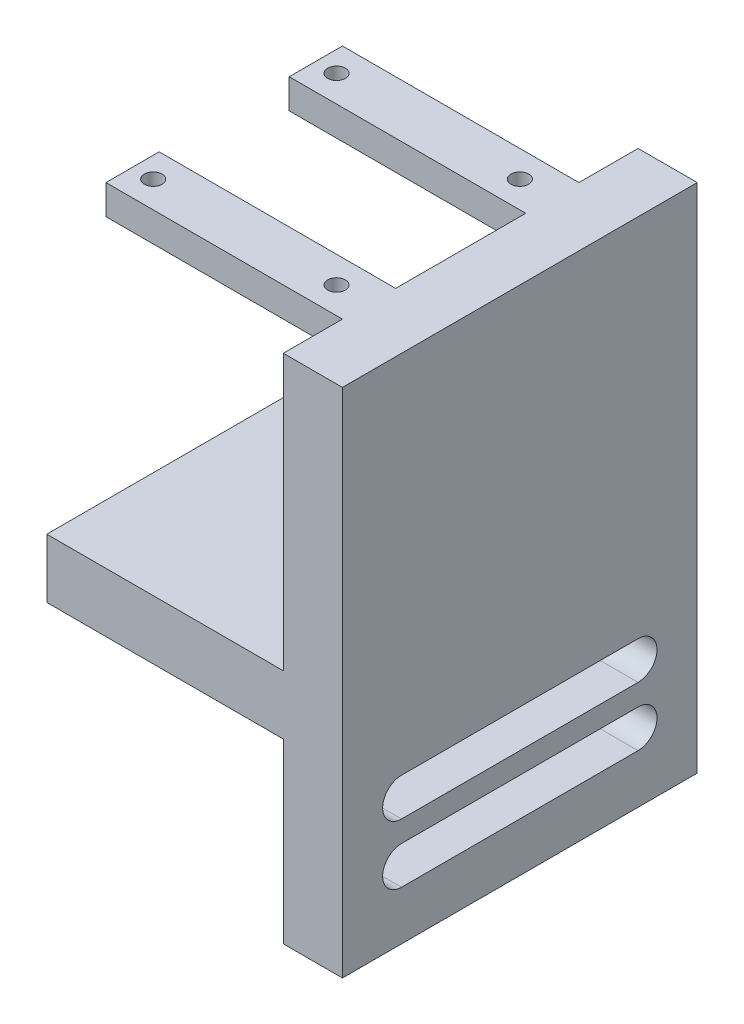
ISO-10303-21;
HEADER;
FILE_DESCRIPTION(('STEP AP214'),'2;1');
FILE_NAME('part.step','',(''),(''),'','','');
FILE_SCHEMA(('AUTOMOTIVE_DESIGN { 1 0 10303 214 1 1 1 1 }'));
ENDSEC;
DATA;
#1=APPLICATION_CONTEXT('core data for automotive mechanical design processes');
#2=APPLICATION_PROTOCOL_DEFINITION('international standard','automotive_design',2000,#1);
#3=PRODUCT_CONTEXT('',#1,'mechanical');
#4=PRODUCT('Part','Part','',(#3));
#5=PRODUCT_RELATED_PRODUCT_CATEGORY('part','',(#4));
#6=PRODUCT_DEFINITION_FORMATION('','',#4);
#7=PRODUCT_DEFINITION_CONTEXT('part definition',#1,'design');
#8=PRODUCT_DEFINITION('design','',#6,#7);
#9=PRODUCT_DEFINITION_SHAPE('','',#8);
#10=(LENGTH_UNIT() NAMED_UNIT(*) SI_UNIT(.MILLI.,.METRE.));
#11=(NAMED_UNIT(*) PLANE_ANGLE_UNIT() SI_UNIT($,.RADIAN.));
#12=(NAMED_UNIT(*) SI_UNIT($,.STERADIAN.) SOLID_ANGLE_UNIT());
#13=UNCERTAINTY_MEASURE_WITH_UNIT(LENGTH_MEASURE(1.E-05),#10,'distance_accuracy_value','');
#14=(GEOMETRIC_REPRESENTATION_CONTEXT(3) GLOBAL_UNCERTAINTY_ASSIGNED_CONTEXT((#13)) GLOBAL_UNIT_ASSIGNED_CONTEXT((#10,
#11,#12)) REPRESENTATION_CONTEXT('',''));
#15=CARTESIAN_POINT('',(0.,0.,0.));
#16=DIRECTION('',(0.,0.,1.));
#17=DIRECTION('',(1.,0.,0.));
#18=AXIS2_PLACEMENT_3D('',#15,#16,#17);
#19=CARTESIAN_POINT('',(0.,0.,0.));
#20=DIRECTION('',(1.,0.,0.));
#21=DIRECTION('',(0.,0.,-1.));
#22=AXIS2_PLACEMENT_3D('',#19,#20,#21);
#23=PLANE('',#22);
#24=DIRECTION('',(0.,1.,0.));
#25=VECTOR('',#24,1.);
#26=CARTESIAN_POINT('',(0.,56.5,20.));
#27=LINE('',#26,#25);
#28=CARTESIAN_POINT('',(0.,51.5,20.));
#29=VERTEX_POINT('',#28);
#30=CARTESIAN_POINT('',(0.,56.5,20.));
#31=VERTEX_POINT('',#30);
#32=EDGE_CURVE('E62',#29,#31,#27,.T.);
#33=ORIENTED_EDGE('',*,*,#32,.F.);
#34=DIRECTION('',(0.,0.,1.));
#35=VECTOR('',#34,1.);
#36=CARTESIAN_POINT('',(0.,51.5,20.));
#37=LINE('',#36,#35);
#38=CARTESIAN_POINT('',(0.,51.5,11.));
#39=VERTEX_POINT('',#38);
#40=EDGE_CURVE('E66',#39,#29,#37,.T.);
#41=ORIENTED_EDGE('',*,*,#40,.F.);
#42=DIRECTION('',(0.,-1.,0.));
#43=VECTOR('',#42,1.);
#44=CARTESIAN_POINT('',(0.,56.5,11.));
#45=LINE('',#44,#43);
#46=CARTESIAN_POINT('',(0.,56.5,11.));
#47=VERTEX_POINT('',#46);
#48=EDGE_CURVE('E220',#47,#39,#45,.T.);
#49=ORIENTED_EDGE('',*,*,#48,.F.);
#50=DIRECTION('',(0.,0.,-1.));
#51=VECTOR('',#50,1.);
#52=CARTESIAN_POINT('',(0.,56.5,0.));
#53=LINE('',#52,#51);
#54=CARTESIAN_POINT('',(0.,56.5,-11.));
#55=VERTEX_POINT('',#54);
#56=EDGE_CURVE('E207',#47,#55,#53,.T.);
#57=ORIENTED_EDGE('',*,*,#56,.T.);
#58=DIRECTION('',(0.,1.,0.));
#59=VECTOR('',#58,1.);
#60=CARTESIAN_POINT('',(0.,56.5,-11.));
#61=LINE('',#60,#59);
#62=CARTESIAN_POINT('',(0.,51.5,-11.));
#63=VERTEX_POINT('',#62);
#64=EDGE_CURVE('E254',#63,#55,#61,.T.);
#65=ORIENTED_EDGE('',*,*,#64,.F.);
#66=DIRECTION('',(0.,0.,1.));
#67=VECTOR('',#66,1.);
#68=CARTESIAN_POINT('',(0.,51.5,-20.));
#69=LINE('',#68,#67);
#70=CARTESIAN_POINT('',(0.,51.5,-20.));
#71=VERTEX_POINT('',#70);
#72=EDGE_CURVE('E263',#71,#63,#69,.T.);
#73=ORIENTED_EDGE('',*,*,#72,.F.);
#74=DIRECTION('',(0.,-1.,0.));
#75=VECTOR('',#74,1.);
#76=CARTESIAN_POINT('',(0.,56.5,-20.));
#77=LINE('',#76,#75);
#78=CARTESIAN_POINT('',(0.,56.5,-20.));
#79=VERTEX_POINT('',#78);
#80=EDGE_CURVE('E243',#79,#71,#77,.T.);
#81=ORIENTED_EDGE('',*,*,#80,.F.);
#82=CARTESIAN_POINT('',(0.,56.5,-30.));
#83=VERTEX_POINT('',#82);
#84=EDGE_CURVE('E218',#79,#83,#53,.T.);
#85=ORIENTED_EDGE('',*,*,#84,.T.);
#86=DIRECTION('',(0.,-1.,0.));
#87=VECTOR('',#86,1.);
#88=CARTESIAN_POINT('',(0.,0.,-30.));
#89=LINE('',#88,#87);
#90=CARTESIAN_POINT('',(0.,10.,-30.));
#91=VERTEX_POINT('',#90);
#92=EDGE_CURVE('E338',#83,#91,#89,.T.);
#93=ORIENTED_EDGE('',*,*,#92,.T.);
#94=DIRECTION('',(0.,0.,-1.));
#95=VECTOR('',#94,1.);
#96=CARTESIAN_POINT('',(0.,10.,-30.));
#97=LINE('',#96,#95);
#98=CARTESIAN_POINT('',(0.,10.,30.));
#99=VERTEX_POINT('',#98);
#100=EDGE_CURVE('E276',#99,#91,#97,.T.);
#101=ORIENTED_EDGE('',*,*,#100,.F.);
#102=DIRECTION('',(0.,-1.,0.));
#103=VECTOR('',#102,1.);
#104=CARTESIAN_POINT('',(0.,0.,30.));
#105=LINE('',#104,#103);
#106=CARTESIAN_POINT('',(0.,56.5,30.));
#107=VERTEX_POINT('',#106);
#108=EDGE_CURVE('E341',#107,#99,#105,.T.);
#109=ORIENTED_EDGE('',*,*,#108,.F.);
#110=EDGE_CURVE('E217',#107,#31,#53,.T.);
#111=ORIENTED_EDGE('',*,*,#110,.T.);
#112=EDGE_LOOP('',(#33,#41,#49,#57,#65,#73,#81,#85,#93,#101,#109,#111));
#113=FACE_BOUND('',#112,.T.);
#114=ADVANCED_FACE('F45',(#113),#23,.F.);
#115=DIRECTION('',(0.,0.,-1.));
#116=VECTOR('',#115,1.);
#117=CARTESIAN_POINT('',(0.,-5.29999999999999,0.));
#118=LINE('',#117,#116);
#119=CARTESIAN_POINT('',(0.,-5.29999999999999,20.));
#120=VERTEX_POINT('',#119);
#121=CARTESIAN_POINT('',(0.,-5.29999999999999,-20.));
#122=VERTEX_POINT('',#121);
#123=EDGE_CURVE('E359',#120,#122,#118,.T.);
#124=ORIENTED_EDGE('',*,*,#123,.F.);
#125=CARTESIAN_POINT('',(0.,-8.49999999999999,20.));
#126=DIRECTION('',(1.,0.,0.));
#127=DIRECTION('',(0.,0.,-1.));
#128=AXIS2_PLACEMENT_3D('',#125,#126,#127);
#129=CIRCLE('',#128,3.2);
#130=CARTESIAN_POINT('',(0.,-11.7,20.));
#131=VERTEX_POINT('',#130);
#132=EDGE_CURVE('E308',#120,#131,#129,.T.);
#133=ORIENTED_EDGE('',*,*,#132,.T.);
#134=DIRECTION('',(0.,0.,-1.));
#135=VECTOR('',#134,1.);
#136=CARTESIAN_POINT('',(0.,-11.7,0.));
#137=LINE('',#136,#135);
#138=CARTESIAN_POINT('',(0.,-11.7,-20.));
#139=VERTEX_POINT('',#138);
#140=EDGE_CURVE('E365',#131,#139,#137,.T.);
#141=ORIENTED_EDGE('',*,*,#140,.T.);
#142=CARTESIAN_POINT('',(0.,-8.49999999999999,-20.));
#143=DIRECTION('',(1.,0.,0.));
#144=DIRECTION('',(0.,0.,-1.));
#145=AXIS2_PLACEMENT_3D('',#142,#143,#144);
#146=CIRCLE('',#145,3.2);
#147=EDGE_CURVE('E362',#122,#139,#146,.F.);
#148=ORIENTED_EDGE('',*,*,#147,.F.);
#149=EDGE_LOOP('',(#124,#133,#141,#148));
#150=FACE_BOUND('',#149,.T.);
#151=DIRECTION('',(0.,0.,-1.));
#152=VECTOR('',#151,1.);
#153=CARTESIAN_POINT('',(0.,-15.3,0.));
#154=LINE('',#153,#152);
#155=CARTESIAN_POINT('',(0.,-15.3,20.));
#156=VERTEX_POINT('',#155);
#157=CARTESIAN_POINT('',(0.,-15.3,-20.));
#158=VERTEX_POINT('',#157);
#159=EDGE_CURVE('E347',#156,#158,#154,.T.);
#160=ORIENTED_EDGE('',*,*,#159,.F.);
#161=CARTESIAN_POINT('',(0.,-18.5,20.));
#162=DIRECTION('',(1.,0.,0.));
#163=DIRECTION('',(0.,0.,-1.));
#164=AXIS2_PLACEMENT_3D('',#161,#162,#163);
#165=CIRCLE('',#164,3.2);
#166=CARTESIAN_POINT('',(0.,-21.7,20.));
#167=VERTEX_POINT('',#166);
#168=EDGE_CURVE('E356',#156,#167,#165,.T.);
#169=ORIENTED_EDGE('',*,*,#168,.T.);
#170=DIRECTION('',(0.,0.,-1.));
#171=VECTOR('',#170,1.);
#172=CARTESIAN_POINT('',(0.,-21.7,0.));
#173=LINE('',#172,#171);
#174=CARTESIAN_POINT('',(0.,-21.7,-20.));
#175=VERTEX_POINT('',#174);
#176=EDGE_CURVE('E353',#167,#175,#173,.T.);
#177=ORIENTED_EDGE('',*,*,#176,.T.);
#178=CARTESIAN_POINT('',(0.,-18.5,-20.));
#179=DIRECTION('',(1.,0.,0.));
#180=DIRECTION('',(0.,0.,-1.));
#181=AXIS2_PLACEMENT_3D('',#178,#179,#180);
#182=CIRCLE('',#181,3.2);
#183=EDGE_CURVE('E350',#158,#175,#182,.F.);
#184=ORIENTED_EDGE('',*,*,#183,.F.);
#185=EDGE_LOOP('',(#160,#169,#177,#184));
#186=FACE_BOUND('',#185,.T.);
#187=DIRECTION('',(0.,0.,1.));
#188=VECTOR('',#187,1.);
#189=CARTESIAN_POINT('',(0.,0.,-30.));
#190=LINE('',#189,#188);
#191=CARTESIAN_POINT('',(0.,0.,-30.));
#192=VERTEX_POINT('',#191);
#193=CARTESIAN_POINT('',(0.,0.,30.));
#194=VERTEX_POINT('',#193);
#195=EDGE_CURVE('E281',#192,#194,#190,.T.);
#196=ORIENTED_EDGE('',*,*,#195,.F.);
#197=CARTESIAN_POINT('',(0.,-30.,-30.));
#198=VERTEX_POINT('',#197);
#199=EDGE_CURVE('E303',#192,#198,#89,.T.);
#200=ORIENTED_EDGE('',*,*,#199,.T.);
#201=DIRECTION('',(0.,0.,-1.));
#202=VECTOR('',#201,1.);
#203=CARTESIAN_POINT('',(0.,-30.,0.));
#204=LINE('',#203,#202);
#205=CARTESIAN_POINT('',(0.,-30.,30.));
#206=VERTEX_POINT('',#205);
#207=EDGE_CURVE('E344',#206,#198,#204,.T.);
#208=ORIENTED_EDGE('',*,*,#207,.F.);
#209=EDGE_CURVE('E340',#194,#206,#105,.T.);
#210=ORIENTED_EDGE('',*,*,#209,.F.);
#211=EDGE_LOOP('',(#196,#200,#208,#210));
#212=FACE_BOUND('',#211,.T.);
#213=ADVANCED_FACE('F430',(#150,#186,#212),#23,.F.);
#214=CARTESIAN_POINT('',(10.,-5.29999999999999,0.));
#215=DIRECTION('',(0.,1.,0.));
#216=DIRECTION('',(0.,0.,1.));
#217=AXIS2_PLACEMENT_3D('',#214,#215,#216);
#218=PLANE('',#217);
#219=ORIENTED_EDGE('',*,*,#123,.T.);
#220=DIRECTION('',(-1.,0.,0.));
#221=VECTOR('',#220,1.);
#222=CARTESIAN_POINT('',(10.,-5.29999999999999,-20.));
#223=LINE('',#222,#221);
#224=CARTESIAN_POINT('',(10.,-5.29999999999999,-20.));
#225=VERTEX_POINT('',#224);
#226=EDGE_CURVE('E11',#225,#122,#223,.T.);
#227=ORIENTED_EDGE('',*,*,#226,.F.);
#228=DIRECTION('',(0.,0.,-1.));
#229=VECTOR('',#228,1.);
#230=CARTESIAN_POINT('',(10.,-5.29999999999999,0.));
#231=LINE('',#230,#229);
#232=CARTESIAN_POINT('',(10.,-5.29999999999999,20.));
#233=VERTEX_POINT('',#232);
#234=EDGE_CURVE('E326',#233,#225,#231,.T.);
#235=ORIENTED_EDGE('',*,*,#234,.F.);
#236=DIRECTION('',(-1.,0.,0.));
#237=VECTOR('',#236,1.);
#238=CARTESIAN_POINT('',(10.,-5.29999999999999,20.));
#239=LINE('',#238,#237);
#240=EDGE_CURVE('E370',#233,#120,#239,.T.);
#241=ORIENTED_EDGE('',*,*,#240,.T.);
#242=EDGE_LOOP('',(#219,#227,#235,#241));
#243=FACE_BOUND('',#242,.T.);
#244=ADVANCED_FACE('F435',(#243),#218,.F.);
#245=CARTESIAN_POINT('',(10.,-8.49999999999999,-20.));
#246=DIRECTION('',(-1.,0.,0.));
#247=DIRECTION('',(0.,0.,1.));
#248=AXIS2_PLACEMENT_3D('',#245,#246,#247);
#249=CYLINDRICAL_SURFACE('',#248,3.2);
#250=ORIENTED_EDGE('',*,*,#147,.T.);
#251=DIRECTION('',(-1.,0.,0.));
#252=VECTOR('',#251,1.);
#253=CARTESIAN_POINT('',(10.,-11.7,-20.));
#254=LINE('',#253,#252);
#255=CARTESIAN_POINT('',(10.,-11.7,-20.));
#256=VERTEX_POINT('',#255);
#257=EDGE_CURVE('E54',#256,#139,#254,.T.);
#258=ORIENTED_EDGE('',*,*,#257,.F.);
#259=CARTESIAN_POINT('',(10.,-8.49999999999999,-20.));
#260=DIRECTION('',(1.,0.,0.));
#261=DIRECTION('',(0.,0.,-1.));
#262=AXIS2_PLACEMENT_3D('',#259,#260,#261);
#263=CIRCLE('',#262,3.2);
#264=EDGE_CURVE('E329',#225,#256,#263,.F.);
#265=ORIENTED_EDGE('',*,*,#264,.F.);
#266=ORIENTED_EDGE('',*,*,#226,.T.);
#267=EDGE_LOOP('',(#250,#258,#265,#266));
#268=FACE_BOUND('',#267,.T.);
#269=ADVANCED_FACE('F450',(#268),#249,.F.);
#270=CARTESIAN_POINT('',(10.,-11.7,0.));
#271=DIRECTION('',(0.,1.,0.));
#272=DIRECTION('',(0.,0.,1.));
#273=AXIS2_PLACEMENT_3D('',#270,#271,#272);
#274=PLANE('',#273);
#275=ORIENTED_EDGE('',*,*,#140,.F.);
#276=DIRECTION('',(-1.,0.,0.));
#277=VECTOR('',#276,1.);
#278=CARTESIAN_POINT('',(10.,-11.7,20.));
#279=LINE('',#278,#277);
#280=CARTESIAN_POINT('',(10.,-11.7,20.));
#281=VERTEX_POINT('',#280);
#282=EDGE_CURVE('E372',#281,#131,#279,.T.);
#283=ORIENTED_EDGE('',*,*,#282,.F.);
#284=DIRECTION('',(0.,0.,-1.));
#285=VECTOR('',#284,1.);
#286=CARTESIAN_POINT('',(10.,-11.7,0.));
#287=LINE('',#286,#285);
#288=EDGE_CURVE('E331',#281,#256,#287,.T.);
#289=ORIENTED_EDGE('',*,*,#288,.T.);
#290=ORIENTED_EDGE('',*,*,#257,.T.);
#291=EDGE_LOOP('',(#275,#283,#289,#290));
#292=FACE_BOUND('',#291,.T.);
#293=ADVANCED_FACE('F446',(#292),#274,.T.);
#294=CARTESIAN_POINT('',(10.,-15.3,0.));
#295=DIRECTION('',(0.,1.,0.));
#296=DIRECTION('',(0.,0.,1.));
#297=AXIS2_PLACEMENT_3D('',#294,#295,#296);
#298=PLANE('',#297);
#299=ORIENTED_EDGE('',*,*,#159,.T.);
#300=DIRECTION('',(-1.,0.,0.));
#301=VECTOR('',#300,1.);
#302=CARTESIAN_POINT('',(10.,-15.3,-20.));
#303=LINE('',#302,#301);
#304=CARTESIAN_POINT('',(10.,-15.3,-20.));
#305=VERTEX_POINT('',#304);
#306=EDGE_CURVE('E373',#305,#158,#303,.T.);
#307=ORIENTED_EDGE('',*,*,#306,.F.);
#308=DIRECTION('',(0.,0.,-1.));
#309=VECTOR('',#308,1.);
#310=CARTESIAN_POINT('',(10.,-15.3,0.));
#311=LINE('',#310,#309);
#312=CARTESIAN_POINT('',(10.,-15.3,20.));
#313=VERTEX_POINT('',#312);
#314=EDGE_CURVE('E315',#313,#305,#311,.T.);
#315=ORIENTED_EDGE('',*,*,#314,.F.);
#316=DIRECTION('',(-1.,0.,0.));
#317=VECTOR('',#316,1.);
#318=CARTESIAN_POINT('',(10.,-15.3,20.));
#319=LINE('',#318,#317);
#320=EDGE_CURVE('E376',#313,#156,#319,.T.);
#321=ORIENTED_EDGE('',*,*,#320,.T.);
#322=EDGE_LOOP('',(#299,#307,#315,#321));
#323=FACE_BOUND('',#322,.T.);
#324=ADVANCED_FACE('F449',(#323),#298,.F.);
#325=CARTESIAN_POINT('',(10.,-18.5,-20.));
#326=DIRECTION('',(-1.,0.,0.));
#327=DIRECTION('',(0.,0.,1.));
#328=AXIS2_PLACEMENT_3D('',#325,#326,#327);
#329=CYLINDRICAL_SURFACE('',#328,3.2);
#330=ORIENTED_EDGE('',*,*,#183,.T.);
#331=DIRECTION('',(-1.,0.,0.));
#332=VECTOR('',#331,1.);
#333=CARTESIAN_POINT('',(10.,-21.7,-20.));
#334=LINE('',#333,#332);
#335=CARTESIAN_POINT('',(10.,-21.7,-20.));
#336=VERTEX_POINT('',#335);
#337=EDGE_CURVE('E380',#336,#175,#334,.T.);
#338=ORIENTED_EDGE('',*,*,#337,.F.);
#339=CARTESIAN_POINT('',(10.,-18.5,-20.));
#340=DIRECTION('',(1.,0.,0.));
#341=DIRECTION('',(0.,0.,-1.));
#342=AXIS2_PLACEMENT_3D('',#339,#340,#341);
#343=CIRCLE('',#342,3.2);
#344=EDGE_CURVE('E318',#305,#336,#343,.F.);
#345=ORIENTED_EDGE('',*,*,#344,.F.);
#346=ORIENTED_EDGE('',*,*,#306,.T.);
#347=EDGE_LOOP('',(#330,#338,#345,#346));
#348=FACE_BOUND('',#347,.T.);
#349=ADVANCED_FACE('F465',(#348),#329,.F.);
#350=CARTESIAN_POINT('',(10.,-21.7,0.));
#351=DIRECTION('',(0.,1.,0.));
#352=DIRECTION('',(0.,0.,1.));
#353=AXIS2_PLACEMENT_3D('',#350,#351,#352);
#354=PLANE('',#353);
#355=ORIENTED_EDGE('',*,*,#176,.F.);
#356=DIRECTION('',(-1.,0.,0.));
#357=VECTOR('',#356,1.);
#358=CARTESIAN_POINT('',(10.,-21.7,20.));
#359=LINE('',#358,#357);
#360=CARTESIAN_POINT('',(10.,-21.7,20.));
#361=VERTEX_POINT('',#360);
#362=EDGE_CURVE('E378',#361,#167,#359,.T.);
#363=ORIENTED_EDGE('',*,*,#362,.F.);
#364=DIRECTION('',(0.,0.,-1.));
#365=VECTOR('',#364,1.);
#366=CARTESIAN_POINT('',(10.,-21.7,0.));
#367=LINE('',#366,#365);
#368=EDGE_CURVE('E320',#361,#336,#367,.T.);
#369=ORIENTED_EDGE('',*,*,#368,.T.);
#370=ORIENTED_EDGE('',*,*,#337,.T.);
#371=EDGE_LOOP('',(#355,#363,#369,#370));
#372=FACE_BOUND('',#371,.T.);
#373=ADVANCED_FACE('F462',(#372),#354,.T.);
#374=CARTESIAN_POINT('',(10.,0.,-30.));
#375=DIRECTION('',(0.,0.,-1.));
#376=DIRECTION('',(-1.,0.,0.));
#377=AXIS2_PLACEMENT_3D('',#374,#375,#376);
#378=PLANE('',#377);
#379=ORIENTED_EDGE('',*,*,#92,.F.);
#380=DIRECTION('',(-1.,0.,0.));
#381=VECTOR('',#380,1.);
#382=CARTESIAN_POINT('',(10.,56.5,-30.));
#383=LINE('',#382,#381);
#384=CARTESIAN_POINT('',(10.,56.5,-30.));
#385=VERTEX_POINT('',#384);
#386=EDGE_CURVE('E49',#385,#83,#383,.T.);
#387=ORIENTED_EDGE('',*,*,#386,.F.);
#388=DIRECTION('',(0.,-1.,0.));
#389=VECTOR('',#388,1.);
#390=CARTESIAN_POINT('',(10.,0.,-30.));
#391=LINE('',#390,#389);
#392=CARTESIAN_POINT('',(10.,-30.,-30.));
#393=VERTEX_POINT('',#392);
#394=EDGE_CURVE('E304',#385,#393,#391,.T.);
#395=ORIENTED_EDGE('',*,*,#394,.T.);
#396=DIRECTION('',(-1.,0.,0.));
#397=VECTOR('',#396,1.);
#398=CARTESIAN_POINT('',(10.,-30.,-30.));
#399=LINE('',#398,#397);
#400=EDGE_CURVE('E337',#393,#198,#399,.T.);
#401=ORIENTED_EDGE('',*,*,#400,.T.);
#402=ORIENTED_EDGE('',*,*,#199,.F.);
#403=DIRECTION('',(1.,0.,0.));
#404=VECTOR('',#403,1.);
#405=CARTESIAN_POINT('',(-40.,0.,-30.));
#406=LINE('',#405,#404);
#407=CARTESIAN_POINT('',(-40.,0.,-30.));
#408=VERTEX_POINT('',#407);
#409=EDGE_CURVE('E294',#408,#192,#406,.T.);
#410=ORIENTED_EDGE('',*,*,#409,.F.);
#411=DIRECTION('',(0.,-1.,0.));
#412=VECTOR('',#411,1.);
#413=CARTESIAN_POINT('',(-40.,10.,-30.));
#414=LINE('',#413,#412);
#415=CARTESIAN_POINT('',(-40.,10.,-30.));
#416=VERTEX_POINT('',#415);
#417=EDGE_CURVE('E283',#416,#408,#414,.T.);
#418=ORIENTED_EDGE('',*,*,#417,.F.);
#419=DIRECTION('',(1.,0.,0.));
#420=VECTOR('',#419,1.);
#421=CARTESIAN_POINT('',(-40.,10.,-30.));
#422=LINE('',#421,#420);
#423=EDGE_CURVE('E297',#416,#91,#422,.T.);
#424=ORIENTED_EDGE('',*,*,#423,.T.);
#425=EDGE_LOOP('',(#379,#387,#395,#401,#402,#410,#418,#424));
#426=FACE_BOUND('',#425,.T.);
#427=ADVANCED_FACE('F47',(#426),#378,.T.);
#428=CARTESIAN_POINT('',(10.,56.5,0.));
#429=DIRECTION('',(0.,1.,0.));
#430=DIRECTION('',(0.,0.,1.));
#431=AXIS2_PLACEMENT_3D('',#428,#429,#430);
#432=PLANE('',#431);
#433=CARTESIAN_POINT('',(-36.5,56.5,-15.5));
#434=DIRECTION('',(0.,1.,0.));
#435=DIRECTION('',(0.,0.,1.));
#436=AXIS2_PLACEMENT_3D('',#433,#434,#435);
#437=CIRCLE('',#436,1.5);
#438=CARTESIAN_POINT('',(-36.5,56.5,-14.));
#439=VERTEX_POINT('',#438);
#440=EDGE_CURVE('E485',#439,#439,#437,.T.);
#441=ORIENTED_EDGE('',*,*,#440,.F.);
#442=EDGE_LOOP('',(#441));
#443=FACE_BOUND('',#442,.T.);
#444=CARTESIAN_POINT('',(-5.5,56.5,15.5));
#445=DIRECTION('',(0.,1.,0.));
#446=DIRECTION('',(0.,0.,-1.));
#447=AXIS2_PLACEMENT_3D('',#444,#445,#446);
#448=CIRCLE('',#447,1.5);
#449=CARTESIAN_POINT('',(-5.5,56.5,14.));
#450=VERTEX_POINT('',#449);
#451=EDGE_CURVE('E489',#450,#450,#448,.T.);
#452=ORIENTED_EDGE('',*,*,#451,.F.);
#453=EDGE_LOOP('',(#452));
#454=FACE_BOUND('',#453,.T.);
#455=CARTESIAN_POINT('',(-36.5,56.5,15.5));
#456=DIRECTION('',(0.,1.,0.));
#457=DIRECTION('',(0.,0.,-1.));
#458=AXIS2_PLACEMENT_3D('',#455,#456,#457);
#459=CIRCLE('',#458,1.5);
#460=CARTESIAN_POINT('',(-36.5,56.5,14.));
#461=VERTEX_POINT('',#460);
#462=EDGE_CURVE('E493',#461,#461,#459,.T.);
#463=ORIENTED_EDGE('',*,*,#462,.F.);
#464=EDGE_LOOP('',(#463));
#465=FACE_BOUND('',#464,.T.);
#466=CARTESIAN_POINT('',(-5.5,56.5,-15.5));
#467=DIRECTION('',(0.,1.,0.));
#468=DIRECTION('',(0.,0.,1.));
#469=AXIS2_PLACEMENT_3D('',#466,#467,#468);
#470=CIRCLE('',#469,1.5);
#471=CARTESIAN_POINT('',(-5.5,56.5,-14.));
#472=VERTEX_POINT('',#471);
#473=EDGE_CURVE('E233',#472,#472,#470,.T.);
#474=ORIENTED_EDGE('',*,*,#473,.F.);
#475=EDGE_LOOP('',(#474));
#476=FACE_BOUND('',#475,.T.);
#477=ORIENTED_EDGE('',*,*,#110,.F.);
#478=DIRECTION('',(-1.,0.,0.));
#479=VECTOR('',#478,1.);
#480=CARTESIAN_POINT('',(10.,56.5,30.));
#481=LINE('',#480,#479);
#482=CARTESIAN_POINT('',(10.,56.5,30.));
#483=VERTEX_POINT('',#482);
#484=EDGE_CURVE('E388',#483,#107,#481,.T.);
#485=ORIENTED_EDGE('',*,*,#484,.F.);
#486=DIRECTION('',(0.,0.,-1.));
#487=VECTOR('',#486,1.);
#488=CARTESIAN_POINT('',(10.,56.5,0.));
#489=LINE('',#488,#487);
#490=EDGE_CURVE('E307',#483,#385,#489,.T.);
#491=ORIENTED_EDGE('',*,*,#490,.T.);
#492=ORIENTED_EDGE('',*,*,#386,.T.);
#493=ORIENTED_EDGE('',*,*,#84,.F.);
#494=DIRECTION('',(1.,0.,0.));
#495=VECTOR('',#494,1.);
#496=CARTESIAN_POINT('',(-40.,56.5,-20.));
#497=LINE('',#496,#495);
#498=CARTESIAN_POINT('',(-40.,56.5,-20.));
#499=VERTEX_POINT('',#498);
#500=EDGE_CURVE('E260',#499,#79,#497,.T.);
#501=ORIENTED_EDGE('',*,*,#500,.F.);
#502=DIRECTION('',(0.,0.,-1.));
#503=VECTOR('',#502,1.);
#504=CARTESIAN_POINT('',(-40.,56.5,-20.));
#505=LINE('',#504,#503);
#506=CARTESIAN_POINT('',(-40.,56.5,-11.));
#507=VERTEX_POINT('',#506);
#508=EDGE_CURVE('E258',#507,#499,#505,.T.);
#509=ORIENTED_EDGE('',*,*,#508,.F.);
#510=DIRECTION('',(1.,0.,0.));
#511=VECTOR('',#510,1.);
#512=CARTESIAN_POINT('',(-40.,56.5,-11.));
#513=LINE('',#512,#511);
#514=EDGE_CURVE('E215',#507,#55,#513,.T.);
#515=ORIENTED_EDGE('',*,*,#514,.T.);
#516=ORIENTED_EDGE('',*,*,#56,.F.);
#517=DIRECTION('',(1.,0.,0.));
#518=VECTOR('',#517,1.);
#519=CARTESIAN_POINT('',(-40.,56.5,11.));
#520=LINE('',#519,#518);
#521=CARTESIAN_POINT('',(-40.,56.5,11.));
#522=VERTEX_POINT('',#521);
#523=EDGE_CURVE('E211',#522,#47,#520,.T.);
#524=ORIENTED_EDGE('',*,*,#523,.F.);
#525=DIRECTION('',(0.,0.,-1.));
#526=VECTOR('',#525,1.);
#527=CARTESIAN_POINT('',(-40.,56.5,20.));
#528=LINE('',#527,#526);
#529=CARTESIAN_POINT('',(-40.,56.5,20.));
#530=VERTEX_POINT('',#529);
#531=EDGE_CURVE('E246',#530,#522,#528,.T.);
#532=ORIENTED_EDGE('',*,*,#531,.F.);
#533=DIRECTION('',(1.,0.,0.));
#534=VECTOR('',#533,1.);
#535=CARTESIAN_POINT('',(-40.,56.5,20.));
#536=LINE('',#535,#534);
#537=EDGE_CURVE('E228',#530,#31,#536,.T.);
#538=ORIENTED_EDGE('',*,*,#537,.T.);
#539=EDGE_LOOP('',(#477,#485,#491,#492,#493,#501,#509,#515,#516,#524,#532,#538));
#540=FACE_BOUND('',#539,.T.);
#541=ADVANCED_FACE('F209',(#443,#454,#465,#476,#540),#432,.T.);
#542=CARTESIAN_POINT('',(10.,0.,30.));
#543=DIRECTION('',(0.,0.,-1.));
#544=DIRECTION('',(-1.,0.,0.));
#545=AXIS2_PLACEMENT_3D('',#542,#543,#544);
#546=PLANE('',#545);
#547=ORIENTED_EDGE('',*,*,#108,.T.);
#548=DIRECTION('',(1.,0.,0.));
#549=VECTOR('',#548,1.);
#550=CARTESIAN_POINT('',(-40.,10.,30.));
#551=LINE('',#550,#549);
#552=CARTESIAN_POINT('',(-40.,10.,30.));
#553=VERTEX_POINT('',#552);
#554=EDGE_CURVE('E300',#553,#99,#551,.T.);
#555=ORIENTED_EDGE('',*,*,#554,.F.);
#556=DIRECTION('',(0.,1.,0.));
#557=VECTOR('',#556,1.);
#558=CARTESIAN_POINT('',(-40.,10.,30.));
#559=LINE('',#558,#557);
#560=CARTESIAN_POINT('',(-40.,0.,30.));
#561=VERTEX_POINT('',#560);
#562=EDGE_CURVE('E277',#561,#553,#559,.T.);
#563=ORIENTED_EDGE('',*,*,#562,.F.);
#564=DIRECTION('',(1.,0.,0.));
#565=VECTOR('',#564,1.);
#566=CARTESIAN_POINT('',(-40.,0.,30.));
#567=LINE('',#566,#565);
#568=EDGE_CURVE('E287',#561,#194,#567,.T.);
#569=ORIENTED_EDGE('',*,*,#568,.T.);
#570=ORIENTED_EDGE('',*,*,#209,.T.);
#571=DIRECTION('',(-1.,0.,0.));
#572=VECTOR('',#571,1.);
#573=CARTESIAN_POINT('',(10.,-30.,30.));
#574=LINE('',#573,#572);
#575=CARTESIAN_POINT('',(10.,-30.,30.));
#576=VERTEX_POINT('',#575);
#577=EDGE_CURVE('E386',#576,#206,#574,.T.);
#578=ORIENTED_EDGE('',*,*,#577,.F.);
#579=DIRECTION('',(0.,-1.,0.));
#580=VECTOR('',#579,1.);
#581=CARTESIAN_POINT('',(10.,0.,30.));
#582=LINE('',#581,#580);
#583=EDGE_CURVE('E311',#483,#576,#582,.T.);
#584=ORIENTED_EDGE('',*,*,#583,.F.);
#585=ORIENTED_EDGE('',*,*,#484,.T.);
#586=EDGE_LOOP('',(#547,#555,#563,#569,#570,#578,#584,#585));
#587=FACE_BOUND('',#586,.T.);
#588=ADVANCED_FACE('F405',(#587),#546,.F.);
#589=CARTESIAN_POINT('',(10.,-18.5,20.));
#590=DIRECTION('',(-1.,0.,0.));
#591=DIRECTION('',(0.,0.,1.));
#592=AXIS2_PLACEMENT_3D('',#589,#590,#591);
#593=CYLINDRICAL_SURFACE('',#592,3.2);
#594=ORIENTED_EDGE('',*,*,#168,.F.);
#595=ORIENTED_EDGE('',*,*,#320,.F.);
#596=CARTESIAN_POINT('',(10.,-18.5,20.));
#597=DIRECTION('',(1.,0.,0.));
#598=DIRECTION('',(0.,0.,-1.));
#599=AXIS2_PLACEMENT_3D('',#596,#597,#598);
#600=CIRCLE('',#599,3.2);
#601=EDGE_CURVE('E323',#313,#361,#600,.T.);
#602=ORIENTED_EDGE('',*,*,#601,.T.);
#603=ORIENTED_EDGE('',*,*,#362,.T.);
#604=EDGE_LOOP('',(#594,#595,#602,#603));
#605=FACE_BOUND('',#604,.T.);
#606=ADVANCED_FACE('F458',(#605),#593,.F.);
#607=CARTESIAN_POINT('',(10.,-30.,0.));
#608=DIRECTION('',(0.,1.,0.));
#609=DIRECTION('',(0.,0.,1.));
#610=AXIS2_PLACEMENT_3D('',#607,#608,#609);
#611=PLANE('',#610);
#612=ORIENTED_EDGE('',*,*,#207,.T.);
#613=ORIENTED_EDGE('',*,*,#400,.F.);
#614=DIRECTION('',(0.,0.,-1.));
#615=VECTOR('',#614,1.);
#616=CARTESIAN_POINT('',(10.,-30.,0.));
#617=LINE('',#616,#615);
#618=EDGE_CURVE('E313',#576,#393,#617,.T.);
#619=ORIENTED_EDGE('',*,*,#618,.F.);
#620=ORIENTED_EDGE('',*,*,#577,.T.);
#621=EDGE_LOOP('',(#612,#613,#619,#620));
#622=FACE_BOUND('',#621,.T.);
#623=ADVANCED_FACE('F444',(#622),#611,.F.);
#624=CARTESIAN_POINT('',(10.,-8.49999999999999,20.));
#625=DIRECTION('',(-1.,0.,0.));
#626=DIRECTION('',(0.,0.,1.));
#627=AXIS2_PLACEMENT_3D('',#624,#625,#626);
#628=CYLINDRICAL_SURFACE('',#627,3.2);
#629=ORIENTED_EDGE('',*,*,#132,.F.);
#630=ORIENTED_EDGE('',*,*,#240,.F.);
#631=CARTESIAN_POINT('',(10.,-8.49999999999999,20.));
#632=DIRECTION('',(1.,0.,0.));
#633=DIRECTION('',(0.,0.,-1.));
#634=AXIS2_PLACEMENT_3D('',#631,#632,#633);
#635=CIRCLE('',#634,3.2);
#636=EDGE_CURVE('E334',#233,#281,#635,.T.);
#637=ORIENTED_EDGE('',*,*,#636,.T.);
#638=ORIENTED_EDGE('',*,*,#282,.T.);
#639=EDGE_LOOP('',(#629,#630,#637,#638));
#640=FACE_BOUND('',#639,.T.);
#641=ADVANCED_FACE('F441',(#640),#628,.F.);
#642=CARTESIAN_POINT('',(10.,0.,0.));
#643=DIRECTION('',(1.,0.,0.));
#644=DIRECTION('',(0.,0.,-1.));
#645=AXIS2_PLACEMENT_3D('',#642,#643,#644);
#646=PLANE('',#645);
#647=ORIENTED_EDGE('',*,*,#394,.F.);
#648=ORIENTED_EDGE('',*,*,#490,.F.);
#649=ORIENTED_EDGE('',*,*,#583,.T.);
#650=ORIENTED_EDGE('',*,*,#618,.T.);
#651=EDGE_LOOP('',(#647,#648,#649,#650));
#652=FACE_BOUND('',#651,.T.);
#653=ORIENTED_EDGE('',*,*,#314,.T.);
#654=ORIENTED_EDGE('',*,*,#344,.T.);
#655=ORIENTED_EDGE('',*,*,#368,.F.);
#656=ORIENTED_EDGE('',*,*,#601,.F.);
#657=EDGE_LOOP('',(#653,#654,#655,#656));
#658=FACE_BOUND('',#657,.T.);
#659=ORIENTED_EDGE('',*,*,#234,.T.);
#660=ORIENTED_EDGE('',*,*,#264,.T.);
#661=ORIENTED_EDGE('',*,*,#288,.F.);
#662=ORIENTED_EDGE('',*,*,#636,.F.);
#663=EDGE_LOOP('',(#659,#660,#661,#662));
#664=FACE_BOUND('',#663,.T.);
#665=ADVANCED_FACE('F439',(#652,#658,#664),#646,.T.);
#666=CARTESIAN_POINT('',(-40.,10.,-30.));
#667=DIRECTION('',(0.,-1.,0.));
#668=DIRECTION('',(0.,0.,-1.));
#669=AXIS2_PLACEMENT_3D('',#666,#667,#668);
#670=PLANE('',#669);
#671=ORIENTED_EDGE('',*,*,#100,.T.);
#672=ORIENTED_EDGE('',*,*,#423,.F.);
#673=DIRECTION('',(0.,0.,-1.));
#674=VECTOR('',#673,1.);
#675=CARTESIAN_POINT('',(-40.,10.,-30.));
#676=LINE('',#675,#674);
#677=EDGE_CURVE('E280',#553,#416,#676,.T.);
#678=ORIENTED_EDGE('',*,*,#677,.F.);
#679=ORIENTED_EDGE('',*,*,#554,.T.);
#680=EDGE_LOOP('',(#671,#672,#678,#679));
#681=FACE_BOUND('',#680,.T.);
#682=ADVANCED_FACE('F402',(#681),#670,.F.);
#683=CARTESIAN_POINT('',(-40.,0.,-30.));
#684=DIRECTION('',(0.,1.,0.));
#685=DIRECTION('',(0.,0.,1.));
#686=AXIS2_PLACEMENT_3D('',#683,#684,#685);
#687=PLANE('',#686);
#688=ORIENTED_EDGE('',*,*,#195,.T.);
#689=ORIENTED_EDGE('',*,*,#568,.F.);
#690=DIRECTION('',(0.,0.,1.));
#691=VECTOR('',#690,1.);
#692=CARTESIAN_POINT('',(-40.,0.,-30.));
#693=LINE('',#692,#691);
#694=EDGE_CURVE('E285',#408,#561,#693,.T.);
#695=ORIENTED_EDGE('',*,*,#694,.F.);
#696=ORIENTED_EDGE('',*,*,#409,.T.);
#697=EDGE_LOOP('',(#688,#689,#695,#696));
#698=FACE_BOUND('',#697,.T.);
#699=ADVANCED_FACE('F545',(#698),#687,.F.);
#700=CARTESIAN_POINT('',(-40.,0.,0.));
#701=DIRECTION('',(-1.,0.,0.));
#702=DIRECTION('',(0.,0.,1.));
#703=AXIS2_PLACEMENT_3D('',#700,#701,#702);
#704=PLANE('',#703);
#705=ORIENTED_EDGE('',*,*,#562,.T.);
#706=ORIENTED_EDGE('',*,*,#677,.T.);
#707=ORIENTED_EDGE('',*,*,#417,.T.);
#708=ORIENTED_EDGE('',*,*,#694,.T.);
#709=EDGE_LOOP('',(#705,#706,#707,#708));
#710=FACE_BOUND('',#709,.T.);
#711=ADVANCED_FACE('F540',(#710),#704,.T.);
#712=CARTESIAN_POINT('',(-40.,56.5,-20.));
#713=DIRECTION('',(0.,0.,1.));
#714=DIRECTION('',(0.,-1.,0.));
#715=AXIS2_PLACEMENT_3D('',#712,#713,#714);
#716=PLANE('',#715);
#717=ORIENTED_EDGE('',*,*,#80,.T.);
#718=DIRECTION('',(1.,0.,0.));
#719=VECTOR('',#718,1.);
#720=CARTESIAN_POINT('',(-40.,51.5,-20.));
#721=LINE('',#720,#719);
#722=CARTESIAN_POINT('',(-40.,51.5,-20.));
#723=VERTEX_POINT('',#722);
#724=EDGE_CURVE('E273',#723,#71,#721,.T.);
#725=ORIENTED_EDGE('',*,*,#724,.F.);
#726=DIRECTION('',(0.,-1.,0.));
#727=VECTOR('',#726,1.);
#728=CARTESIAN_POINT('',(-40.,56.5,-20.));
#729=LINE('',#728,#727);
#730=EDGE_CURVE('E250',#499,#723,#729,.T.);
#731=ORIENTED_EDGE('',*,*,#730,.F.);
#732=ORIENTED_EDGE('',*,*,#500,.T.);
#733=EDGE_LOOP('',(#717,#725,#731,#732));
#734=FACE_BOUND('',#733,.T.);
#735=ADVANCED_FACE('F527',(#734),#716,.F.);
#736=CARTESIAN_POINT('',(-40.,51.5,-20.));
#737=DIRECTION('',(0.,1.,0.));
#738=DIRECTION('',(0.,0.,1.));
#739=AXIS2_PLACEMENT_3D('',#736,#737,#738);
#740=PLANE('',#739);
#741=CARTESIAN_POINT('',(-36.5,51.5,-15.5));
#742=DIRECTION('',(0.,1.,0.));
#743=DIRECTION('',(0.,0.,1.));
#744=AXIS2_PLACEMENT_3D('',#741,#742,#743);
#745=CIRCLE('',#744,1.5);
#746=CARTESIAN_POINT('',(-36.5,51.5,-14.));
#747=VERTEX_POINT('',#746);
#748=EDGE_CURVE('E499',#747,#747,#745,.F.);
#749=ORIENTED_EDGE('',*,*,#748,.F.);
#750=EDGE_LOOP('',(#749));
#751=FACE_BOUND('',#750,.T.);
#752=CARTESIAN_POINT('',(-5.5,51.5,-15.5));
#753=DIRECTION('',(0.,1.,0.));
#754=DIRECTION('',(0.,0.,1.));
#755=AXIS2_PLACEMENT_3D('',#752,#753,#754);
#756=CIRCLE('',#755,1.5);
#757=CARTESIAN_POINT('',(-5.5,51.5,-14.));
#758=VERTEX_POINT('',#757);
#759=EDGE_CURVE('E497',#758,#758,#756,.F.);
#760=ORIENTED_EDGE('',*,*,#759,.F.);
#761=EDGE_LOOP('',(#760));
#762=FACE_BOUND('',#761,.T.);
#763=ORIENTED_EDGE('',*,*,#72,.T.);
#764=DIRECTION('',(1.,0.,0.));
#765=VECTOR('',#764,1.);
#766=CARTESIAN_POINT('',(-40.,51.5,-11.));
#767=LINE('',#766,#765);
#768=CARTESIAN_POINT('',(-40.,51.5,-11.));
#769=VERTEX_POINT('',#768);
#770=EDGE_CURVE('E270',#769,#63,#767,.T.);
#771=ORIENTED_EDGE('',*,*,#770,.F.);
#772=DIRECTION('',(0.,0.,1.));
#773=VECTOR('',#772,1.);
#774=CARTESIAN_POINT('',(-40.,51.5,-20.));
#775=LINE('',#774,#773);
#776=EDGE_CURVE('E253',#723,#769,#775,.T.);
#777=ORIENTED_EDGE('',*,*,#776,.F.);
#778=ORIENTED_EDGE('',*,*,#724,.T.);
#779=EDGE_LOOP('',(#763,#771,#777,#778));
#780=FACE_BOUND('',#779,.T.);
#781=ADVANCED_FACE('F523',(#751,#762,#780),#740,.F.);
#782=CARTESIAN_POINT('',(-40.,56.5,-11.));
#783=DIRECTION('',(0.,0.,-1.));
#784=DIRECTION('',(-1.,0.,0.));
#785=AXIS2_PLACEMENT_3D('',#782,#783,#784);
#786=PLANE('',#785);
#787=ORIENTED_EDGE('',*,*,#64,.T.);
#788=ORIENTED_EDGE('',*,*,#514,.F.);
#789=DIRECTION('',(0.,1.,0.));
#790=VECTOR('',#789,1.);
#791=CARTESIAN_POINT('',(-40.,56.5,-11.));
#792=LINE('',#791,#790);
#793=EDGE_CURVE('E256',#769,#507,#792,.T.);
#794=ORIENTED_EDGE('',*,*,#793,.F.);
#795=ORIENTED_EDGE('',*,*,#770,.T.);
#796=EDGE_LOOP('',(#787,#788,#794,#795));
#797=FACE_BOUND('',#796,.T.);
#798=ADVANCED_FACE('F526',(#797),#786,.F.);
#799=CARTESIAN_POINT('',(-40.,0.,0.));
#800=DIRECTION('',(-1.,0.,0.));
#801=DIRECTION('',(0.,0.,1.));
#802=AXIS2_PLACEMENT_3D('',#799,#800,#801);
#803=PLANE('',#802);
#804=ORIENTED_EDGE('',*,*,#730,.T.);
#805=ORIENTED_EDGE('',*,*,#776,.T.);
#806=ORIENTED_EDGE('',*,*,#793,.T.);
#807=ORIENTED_EDGE('',*,*,#508,.T.);
#808=EDGE_LOOP('',(#804,#805,#806,#807));
#809=FACE_BOUND('',#808,.T.);
#810=ADVANCED_FACE('F536',(#809),#803,.T.);
#811=CARTESIAN_POINT('',(-40.,56.5,20.));
#812=DIRECTION('',(0.,0.,-1.));
#813=DIRECTION('',(0.,1.,0.));
#814=AXIS2_PLACEMENT_3D('',#811,#812,#813);
#815=PLANE('',#814);
#816=ORIENTED_EDGE('',*,*,#32,.T.);
#817=ORIENTED_EDGE('',*,*,#537,.F.);
#818=DIRECTION('',(0.,1.,0.));
#819=VECTOR('',#818,1.);
#820=CARTESIAN_POINT('',(-40.,56.5,20.));
#821=LINE('',#820,#819);
#822=CARTESIAN_POINT('',(-40.,51.5,20.));
#823=VERTEX_POINT('',#822);
#824=EDGE_CURVE('E240',#823,#530,#821,.T.);
#825=ORIENTED_EDGE('',*,*,#824,.F.);
#826=DIRECTION('',(1.,0.,0.));
#827=VECTOR('',#826,1.);
#828=CARTESIAN_POINT('',(-40.,51.5,20.));
#829=LINE('',#828,#827);
#830=EDGE_CURVE('E230',#823,#29,#829,.T.);
#831=ORIENTED_EDGE('',*,*,#830,.T.);
#832=EDGE_LOOP('',(#816,#817,#825,#831));
#833=FACE_BOUND('',#832,.T.);
#834=ADVANCED_FACE('F409',(#833),#815,.F.);
#835=CARTESIAN_POINT('',(-40.,56.5,11.));
#836=DIRECTION('',(0.,0.,1.));
#837=DIRECTION('',(1.,0.,0.));
#838=AXIS2_PLACEMENT_3D('',#835,#836,#837);
#839=PLANE('',#838);
#840=ORIENTED_EDGE('',*,*,#48,.T.);
#841=DIRECTION('',(1.,0.,0.));
#842=VECTOR('',#841,1.);
#843=CARTESIAN_POINT('',(-40.,51.5,11.));
#844=LINE('',#843,#842);
#845=CARTESIAN_POINT('',(-40.,51.5,11.));
#846=VERTEX_POINT('',#845);
#847=EDGE_CURVE('E227',#846,#39,#844,.T.);
#848=ORIENTED_EDGE('',*,*,#847,.F.);
#849=DIRECTION('',(0.,-1.,0.));
#850=VECTOR('',#849,1.);
#851=CARTESIAN_POINT('',(-40.,56.5,11.));
#852=LINE('',#851,#850);
#853=EDGE_CURVE('E226',#522,#846,#852,.T.);
#854=ORIENTED_EDGE('',*,*,#853,.F.);
#855=ORIENTED_EDGE('',*,*,#523,.T.);
#856=EDGE_LOOP('',(#840,#848,#854,#855));
#857=FACE_BOUND('',#856,.T.);
#858=ADVANCED_FACE('F225',(#857),#839,.F.);
#859=CARTESIAN_POINT('',(-40.,51.5,20.));
#860=DIRECTION('',(0.,1.,0.));
#861=DIRECTION('',(0.,0.,1.));
#862=AXIS2_PLACEMENT_3D('',#859,#860,#861);
#863=PLANE('',#862);
#864=CARTESIAN_POINT('',(-5.5,51.5,15.5));
#865=DIRECTION('',(0.,1.,0.));
#866=DIRECTION('',(0.,0.,1.));
#867=AXIS2_PLACEMENT_3D('',#864,#865,#866);
#868=CIRCLE('',#867,1.5);
#869=CARTESIAN_POINT('',(-5.5,51.5,17.));
#870=VERTEX_POINT('',#869);
#871=EDGE_CURVE('E502',#870,#870,#868,.F.);
#872=ORIENTED_EDGE('',*,*,#871,.F.);
#873=EDGE_LOOP('',(#872));
#874=FACE_BOUND('',#873,.T.);
#875=CARTESIAN_POINT('',(-36.5,51.5,15.5));
#876=DIRECTION('',(0.,1.,0.));
#877=DIRECTION('',(0.,0.,1.));
#878=AXIS2_PLACEMENT_3D('',#875,#876,#877);
#879=CIRCLE('',#878,1.5);
#880=CARTESIAN_POINT('',(-36.5,51.5,17.));
#881=VERTEX_POINT('',#880);
#882=EDGE_CURVE('E506',#881,#881,#879,.F.);
#883=ORIENTED_EDGE('',*,*,#882,.F.);
#884=EDGE_LOOP('',(#883));
#885=FACE_BOUND('',#884,.T.);
#886=ORIENTED_EDGE('',*,*,#40,.T.);
#887=ORIENTED_EDGE('',*,*,#830,.F.);
#888=DIRECTION('',(0.,0.,1.));
#889=VECTOR('',#888,1.);
#890=CARTESIAN_POINT('',(-40.,51.5,20.));
#891=LINE('',#890,#889);
#892=EDGE_CURVE('E239',#846,#823,#891,.T.);
#893=ORIENTED_EDGE('',*,*,#892,.F.);
#894=ORIENTED_EDGE('',*,*,#847,.T.);
#895=EDGE_LOOP('',(#886,#887,#893,#894));
#896=FACE_BOUND('',#895,.T.);
#897=ADVANCED_FACE('F413',(#874,#885,#896),#863,.F.);
#898=CARTESIAN_POINT('',(-40.,0.,0.));
#899=DIRECTION('',(1.,0.,0.));
#900=DIRECTION('',(0.,0.,-1.));
#901=AXIS2_PLACEMENT_3D('',#898,#899,#900);
#902=PLANE('',#901);
#903=ORIENTED_EDGE('',*,*,#824,.T.);
#904=ORIENTED_EDGE('',*,*,#531,.T.);
#905=ORIENTED_EDGE('',*,*,#853,.T.);
#906=ORIENTED_EDGE('',*,*,#892,.T.);
#907=EDGE_LOOP('',(#903,#904,#905,#906));
#908=FACE_BOUND('',#907,.T.);
#909=ADVANCED_FACE('F415',(#908),#902,.F.);
#910=CARTESIAN_POINT('',(-36.5,-30.001,15.5));
#911=DIRECTION('',(0.,1.,0.));
#912=DIRECTION('',(0.,0.,1.));
#913=AXIS2_PLACEMENT_3D('',#910,#911,#912);
#914=CYLINDRICAL_SURFACE('',#913,1.5);
#915=ORIENTED_EDGE('',*,*,#462,.T.);
#916=EDGE_LOOP('',(#915));
#917=FACE_BOUND('',#916,.T.);
#918=ORIENTED_EDGE('',*,*,#882,.T.);
#919=EDGE_LOOP('',(#918));
#920=FACE_BOUND('',#919,.T.);
#921=ADVANCED_FACE('F417',(#917,#920),#914,.F.);
#922=CARTESIAN_POINT('',(-5.5,-30.001,15.5));
#923=DIRECTION('',(0.,1.,0.));
#924=DIRECTION('',(0.,0.,1.));
#925=AXIS2_PLACEMENT_3D('',#922,#923,#924);
#926=CYLINDRICAL_SURFACE('',#925,1.5);
#927=ORIENTED_EDGE('',*,*,#451,.T.);
#928=EDGE_LOOP('',(#927));
#929=FACE_BOUND('',#928,.T.);
#930=ORIENTED_EDGE('',*,*,#871,.T.);
#931=EDGE_LOOP('',(#930));
#932=FACE_BOUND('',#931,.T.);
#933=ADVANCED_FACE('F423',(#929,#932),#926,.F.);
#934=CARTESIAN_POINT('',(-5.5,-30.001,-15.5));
#935=DIRECTION('',(0.,1.,0.));
#936=DIRECTION('',(0.,0.,1.));
#937=AXIS2_PLACEMENT_3D('',#934,#935,#936);
#938=CYLINDRICAL_SURFACE('',#937,1.5);
#939=ORIENTED_EDGE('',*,*,#473,.T.);
#940=EDGE_LOOP('',(#939));
#941=FACE_BOUND('',#940,.T.);
#942=ORIENTED_EDGE('',*,*,#759,.T.);
#943=EDGE_LOOP('',(#942));
#944=FACE_BOUND('',#943,.T.);
#945=ADVANCED_FACE('F519',(#941,#944),#938,.F.);
#946=CARTESIAN_POINT('',(-36.5,-30.001,-15.5));
#947=DIRECTION('',(0.,1.,0.));
#948=DIRECTION('',(0.,0.,1.));
#949=AXIS2_PLACEMENT_3D('',#946,#947,#948);
#950=CYLINDRICAL_SURFACE('',#949,1.5);
#951=ORIENTED_EDGE('',*,*,#440,.T.);
#952=EDGE_LOOP('',(#951));
#953=FACE_BOUND('',#952,.T.);
#954=ORIENTED_EDGE('',*,*,#748,.T.);
#955=EDGE_LOOP('',(#954));
#956=FACE_BOUND('',#955,.T.);
#957=ADVANCED_FACE('F516',(#953,#956),#950,.F.);
#958=CLOSED_SHELL('',(#114,#213,#244,#269,#293,#324,#349,#373,#427,#541,#588,#606,#623,#641,
#665,#682,#699,#711,#735,#781,#798,#810,#834,#858,#897,#909,#921,#933,#945,#957));
#959=MANIFOLD_SOLID_BREP('B2',#958);
#960=ADVANCED_BREP_SHAPE_REPRESENTATION('',(#18,#959),#14);
#961=SHAPE_DEFINITION_REPRESENTATION(#9,#960);
ENDSEC;
END-ISO-10303-21;
